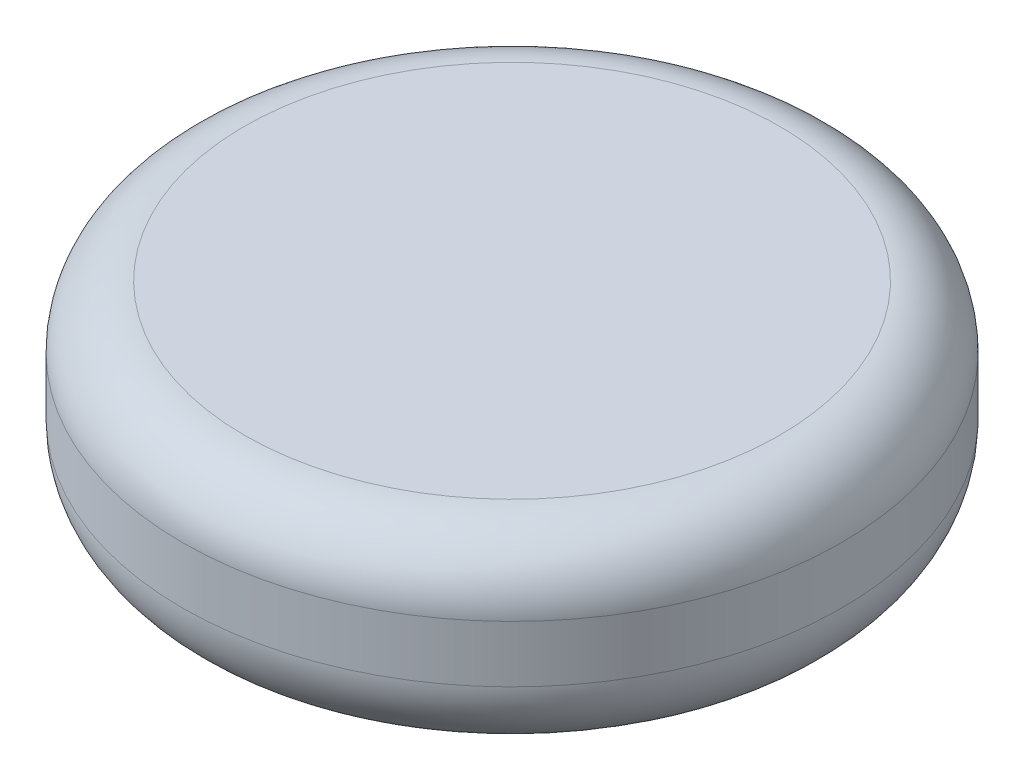
ISO-10303-21;
HEADER;
FILE_DESCRIPTION(('STEP AP214'),'2;1');
FILE_NAME('part.step','',(''),(''),'','','');
FILE_SCHEMA(('AUTOMOTIVE_DESIGN { 1 0 10303 214 1 1 1 1 }'));
ENDSEC;
DATA;
#1=APPLICATION_CONTEXT('core data for automotive mechanical design processes');
#2=APPLICATION_PROTOCOL_DEFINITION('international standard','automotive_design',2000,#1);
#3=PRODUCT_CONTEXT('',#1,'mechanical');
#4=PRODUCT('Part','Part','',(#3));
#5=PRODUCT_RELATED_PRODUCT_CATEGORY('part','',(#4));
#6=PRODUCT_DEFINITION_FORMATION('','',#4);
#7=PRODUCT_DEFINITION_CONTEXT('part definition',#1,'design');
#8=PRODUCT_DEFINITION('design','',#6,#7);
#9=PRODUCT_DEFINITION_SHAPE('','',#8);
#10=(LENGTH_UNIT() NAMED_UNIT(*) SI_UNIT(.MILLI.,.METRE.));
#11=(NAMED_UNIT(*) PLANE_ANGLE_UNIT() SI_UNIT($,.RADIAN.));
#12=(NAMED_UNIT(*) SI_UNIT($,.STERADIAN.) SOLID_ANGLE_UNIT());
#13=UNCERTAINTY_MEASURE_WITH_UNIT(LENGTH_MEASURE(1.E-05),#10,'distance_accuracy_value','');
#14=(GEOMETRIC_REPRESENTATION_CONTEXT(3) GLOBAL_UNCERTAINTY_ASSIGNED_CONTEXT((#13)) GLOBAL_UNIT_ASSIGNED_CONTEXT((#10,
#11,#12)) REPRESENTATION_CONTEXT('',''));
#15=CARTESIAN_POINT('',(0.,0.,0.));
#16=DIRECTION('',(0.,0.,1.));
#17=DIRECTION('',(1.,0.,0.));
#18=AXIS2_PLACEMENT_3D('',#15,#16,#17);
#19=CARTESIAN_POINT('',(0.,150.,0.));
#20=DIRECTION('',(0.,-1.,0.));
#21=DIRECTION('',(0.,0.,-1.));
#22=AXIS2_PLACEMENT_3D('',#19,#20,#21);
#23=CYLINDRICAL_SURFACE('',#22,250.);
#24=CARTESIAN_POINT('',(0.,103.,0.));
#25=DIRECTION('',(0.,1.,0.));
#26=DIRECTION('',(0.,0.,1.));
#27=AXIS2_PLACEMENT_3D('',#24,#25,#26);
#28=CIRCLE('',#27,250.);
#29=CARTESIAN_POINT('',(0.,103.,250.));
#30=VERTEX_POINT('',#29);
#31=EDGE_CURVE('E48',#30,#30,#28,.F.);
#32=ORIENTED_EDGE('',*,*,#31,.T.);
#33=EDGE_LOOP('',(#32));
#34=FACE_BOUND('',#33,.T.);
#35=CARTESIAN_POINT('',(0.,60.,0.));
#36=DIRECTION('',(0.,1.,0.));
#37=DIRECTION('',(0.,0.,1.));
#38=AXIS2_PLACEMENT_3D('',#35,#36,#37);
#39=CIRCLE('',#38,250.);
#40=CARTESIAN_POINT('',(0.,60.,250.));
#41=VERTEX_POINT('',#40);
#42=EDGE_CURVE('E56',#41,#41,#39,.T.);
#43=ORIENTED_EDGE('',*,*,#42,.T.);
#44=EDGE_LOOP('',(#43));
#45=FACE_BOUND('',#44,.T.);
#46=ADVANCED_FACE('F33',(#34,#45),#23,.T.);
#47=CARTESIAN_POINT('',(0.,150.,0.));
#48=DIRECTION('',(0.,1.,0.));
#49=DIRECTION('',(0.,0.,1.));
#50=AXIS2_PLACEMENT_3D('',#47,#48,#49);
#51=PLANE('',#50);
#52=CARTESIAN_POINT('',(0.,150.,0.));
#53=DIRECTION('',(0.,1.,0.));
#54=DIRECTION('',(0.,0.,1.));
#55=AXIS2_PLACEMENT_3D('',#52,#53,#54);
#56=CIRCLE('',#55,203.);
#57=CARTESIAN_POINT('',(0.,150.,203.));
#58=VERTEX_POINT('',#57);
#59=EDGE_CURVE('E53',#58,#58,#56,.T.);
#60=ORIENTED_EDGE('',*,*,#59,.T.);
#61=EDGE_LOOP('',(#60));
#62=FACE_BOUND('',#61,.T.);
#63=ADVANCED_FACE('F64',(#62),#51,.T.);
#64=CARTESIAN_POINT('',(0.,60.,0.));
#65=DIRECTION('',(0.,1.,0.));
#66=DIRECTION('',(0.,0.,1.));
#67=AXIS2_PLACEMENT_3D('',#64,#65,#66);
#68=TOROIDAL_SURFACE('',#67,190.,60.);
#69=CARTESIAN_POINT('',(0.,15.3061224489794,0.));
#70=DIRECTION('',(0.,1.,0.));
#71=DIRECTION('',(0.,0.,1.));
#72=AXIS2_PLACEMENT_3D('',#69,#70,#71);
#73=CIRCLE('',#72,230.030704583537);
#74=CARTESIAN_POINT('',(0.,15.3061224489794,230.030704583537));
#75=VERTEX_POINT('',#74);
#76=EDGE_CURVE('E44',#75,#75,#73,.T.);
#77=ORIENTED_EDGE('',*,*,#76,.T.);
#78=EDGE_LOOP('',(#77));
#79=FACE_BOUND('',#78,.T.);
#80=ORIENTED_EDGE('',*,*,#42,.F.);
#81=EDGE_LOOP('',(#80));
#82=FACE_BOUND('',#81,.T.);
#83=ADVANCED_FACE('F61',(#79,#82),#68,.T.);
#84=CARTESIAN_POINT('',(0.,103.,0.));
#85=DIRECTION('',(0.,1.,0.));
#86=DIRECTION('',(0.,0.,1.));
#87=AXIS2_PLACEMENT_3D('',#84,#85,#86);
#88=TOROIDAL_SURFACE('',#87,203.,47.);
#89=ORIENTED_EDGE('',*,*,#31,.F.);
#90=EDGE_LOOP('',(#89));
#91=FACE_BOUND('',#90,.T.);
#92=ORIENTED_EDGE('',*,*,#59,.F.);
#93=EDGE_LOOP('',(#92));
#94=FACE_BOUND('',#93,.T.);
#95=ADVANCED_FACE('F63',(#91,#94),#88,.T.);
#96=CARTESIAN_POINT('',(0.,25.,0.));
#97=DIRECTION('',(0.,1.,0.));
#98=DIRECTION('',(0.,0.,1.));
#99=AXIS2_PLACEMENT_3D('',#96,#97,#98);
#100=PLANE('',#99);
#101=CARTESIAN_POINT('',(0.,25.,0.));
#102=DIRECTION('',(0.,1.,0.));
#103=DIRECTION('',(0.,0.,1.));
#104=AXIS2_PLACEMENT_3D('',#101,#102,#103);
#105=CIRCLE('',#104,184.858364139652);
#106=CARTESIAN_POINT('',(0.,25.,184.858364139652));
#107=VERTEX_POINT('',#106);
#108=EDGE_CURVE('E10',#107,#107,#105,.F.);
#109=ORIENTED_EDGE('',*,*,#108,.T.);
#110=EDGE_LOOP('',(#109));
#111=FACE_BOUND('',#110,.T.);
#112=ADVANCED_FACE('F71',(#111),#100,.F.);
#113=CARTESIAN_POINT('',(0.,33.9285714285714,0.));
#114=DIRECTION('',(0.,-1.,0.));
#115=DIRECTION('',(0.,0.,-1.));
#116=AXIS2_PLACEMENT_3D('',#113,#114,#115);
#117=TOROIDAL_SURFACE('',#116,213.351244340396,25.);
#118=CARTESIAN_POINT('',(0.,15.4387024202046,0.));
#119=DIRECTION('',(0.,1.,0.));
#120=DIRECTION('',(0.,0.,1.));
#121=AXIS2_PLACEMENT_3D('',#118,#119,#120);
#122=CIRCLE('',#121,196.524933275477);
#123=CARTESIAN_POINT('',(0.,15.4387024202046,196.524933275477));
#124=VERTEX_POINT('',#123);
#125=EDGE_CURVE('E40',#124,#124,#122,.T.);
#126=ORIENTED_EDGE('',*,*,#125,.T.);
#127=EDGE_LOOP('',(#126));
#128=FACE_BOUND('',#127,.T.);
#129=ORIENTED_EDGE('',*,*,#76,.F.);
#130=EDGE_LOOP('',(#129));
#131=FACE_BOUND('',#130,.T.);
#132=ADVANCED_FACE('F83',(#128,#131),#117,.T.);
#133=CARTESIAN_POINT('',(0.,15.4387024202046,0.));
#134=DIRECTION('',(0.,-1.,0.));
#135=DIRECTION('',(0.,0.,-1.));
#136=AXIS2_PLACEMENT_3D('',#133,#134,#135);
#137=CONICAL_SURFACE('',#136,196.524933275477,0.884249818508088);
#138=ORIENTED_EDGE('',*,*,#108,.F.);
#139=EDGE_LOOP('',(#138));
#140=FACE_BOUND('',#139,.T.);
#141=ORIENTED_EDGE('',*,*,#125,.F.);
#142=EDGE_LOOP('',(#141));
#143=FACE_BOUND('',#142,.T.);
#144=ADVANCED_FACE('F35',(#140,#143),#137,.F.);
#145=CLOSED_SHELL('',(#46,#63,#83,#95,#112,#132,#144));
#146=MANIFOLD_SOLID_BREP('B2',#145);
#147=ADVANCED_BREP_SHAPE_REPRESENTATION('',(#18,#146),#14);
#148=SHAPE_DEFINITION_REPRESENTATION(#9,#147);
ENDSEC;
END-ISO-10303-21;
